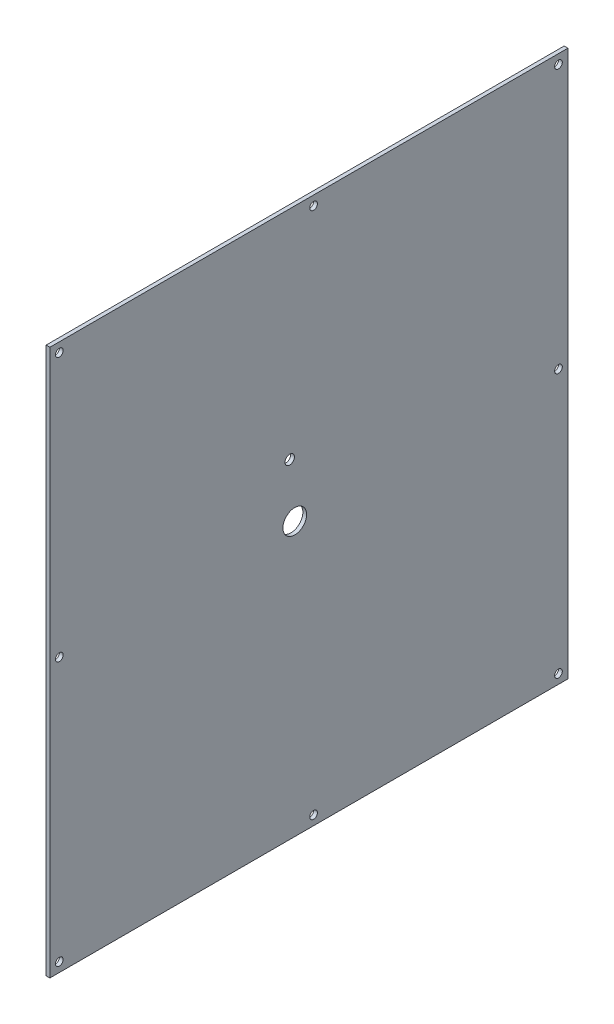
ISO-10303-21;
HEADER;
FILE_DESCRIPTION(('STEP AP214'),'2;1');
FILE_NAME('part.step','',(''),(''),'','','');
FILE_SCHEMA(('AUTOMOTIVE_DESIGN { 1 0 10303 214 1 1 1 1 }'));
ENDSEC;
DATA;
#1=APPLICATION_CONTEXT('core data for automotive mechanical design processes');
#2=APPLICATION_PROTOCOL_DEFINITION('international standard','automotive_design',2000,#1);
#3=PRODUCT_CONTEXT('',#1,'mechanical');
#4=PRODUCT('Part','Part','',(#3));
#5=PRODUCT_RELATED_PRODUCT_CATEGORY('part','',(#4));
#6=PRODUCT_DEFINITION_FORMATION('','',#4);
#7=PRODUCT_DEFINITION_CONTEXT('part definition',#1,'design');
#8=PRODUCT_DEFINITION('design','',#6,#7);
#9=PRODUCT_DEFINITION_SHAPE('','',#8);
#10=(LENGTH_UNIT() NAMED_UNIT(*) SI_UNIT(.MILLI.,.METRE.));
#11=(NAMED_UNIT(*) PLANE_ANGLE_UNIT() SI_UNIT($,.RADIAN.));
#12=(NAMED_UNIT(*) SI_UNIT($,.STERADIAN.) SOLID_ANGLE_UNIT());
#13=UNCERTAINTY_MEASURE_WITH_UNIT(LENGTH_MEASURE(1.E-05),#10,'distance_accuracy_value','');
#14=(GEOMETRIC_REPRESENTATION_CONTEXT(3) GLOBAL_UNCERTAINTY_ASSIGNED_CONTEXT((#13)) GLOBAL_UNIT_ASSIGNED_CONTEXT((#10,
#11,#12)) REPRESENTATION_CONTEXT('',''));
#15=CARTESIAN_POINT('',(0.,0.,0.));
#16=DIRECTION('',(0.,0.,1.));
#17=DIRECTION('',(1.,0.,0.));
#18=AXIS2_PLACEMENT_3D('',#15,#16,#17);
#19=CARTESIAN_POINT('',(2.54,0.,0.));
#20=DIRECTION('',(0.,1.,0.));
#21=DIRECTION('',(0.,0.,1.));
#22=AXIS2_PLACEMENT_3D('',#19,#20,#21);
#23=PLANE('',#22);
#24=DIRECTION('',(0.,0.,-1.));
#25=VECTOR('',#24,1.);
#26=CARTESIAN_POINT('',(2.54,0.,0.));
#27=LINE('',#26,#25);
#28=CARTESIAN_POINT('',(2.54,0.,-19.05));
#29=VERTEX_POINT('',#28);
#30=CARTESIAN_POINT('',(2.54,0.,-368.3));
#31=VERTEX_POINT('',#30);
#32=EDGE_CURVE('E95',#29,#31,#27,.T.);
#33=ORIENTED_EDGE('',*,*,#32,.F.);
#34=DIRECTION('',(-1.,0.,0.));
#35=VECTOR('',#34,1.);
#36=CARTESIAN_POINT('',(2.54,0.,-19.05));
#37=LINE('',#36,#35);
#38=CARTESIAN_POINT('',(0.,0.,-19.05));
#39=VERTEX_POINT('',#38);
#40=EDGE_CURVE('E170',#29,#39,#37,.T.);
#41=ORIENTED_EDGE('',*,*,#40,.T.);
#42=DIRECTION('',(0.,0.,-1.));
#43=VECTOR('',#42,1.);
#44=CARTESIAN_POINT('',(0.,0.,0.));
#45=LINE('',#44,#43);
#46=CARTESIAN_POINT('',(0.,0.,-368.3));
#47=VERTEX_POINT('',#46);
#48=EDGE_CURVE('E84',#39,#47,#45,.T.);
#49=ORIENTED_EDGE('',*,*,#48,.T.);
#50=DIRECTION('',(-1.,0.,0.));
#51=VECTOR('',#50,1.);
#52=CARTESIAN_POINT('',(2.54,0.,-368.3));
#53=LINE('',#52,#51);
#54=EDGE_CURVE('E11',#31,#47,#53,.T.);
#55=ORIENTED_EDGE('',*,*,#54,.F.);
#56=EDGE_LOOP('',(#33,#41,#49,#55));
#57=FACE_BOUND('',#56,.T.);
#58=ADVANCED_FACE('F38',(#57),#23,.F.);
#59=CARTESIAN_POINT('',(2.54,0.,-368.3));
#60=DIRECTION('',(0.,0.,1.));
#61=DIRECTION('',(1.,0.,0.));
#62=AXIS2_PLACEMENT_3D('',#59,#60,#61);
#63=PLANE('',#62);
#64=DIRECTION('',(0.,1.,0.));
#65=VECTOR('',#64,1.);
#66=CARTESIAN_POINT('',(0.,0.,-368.3));
#67=LINE('',#66,#65);
#68=CARTESIAN_POINT('',(0.,368.3,-368.3));
#69=VERTEX_POINT('',#68);
#70=EDGE_CURVE('E74',#47,#69,#67,.T.);
#71=ORIENTED_EDGE('',*,*,#70,.T.);
#72=DIRECTION('',(-1.,0.,0.));
#73=VECTOR('',#72,1.);
#74=CARTESIAN_POINT('',(2.54,368.3,-368.3));
#75=LINE('',#74,#73);
#76=CARTESIAN_POINT('',(2.54,368.3,-368.3));
#77=VERTEX_POINT('',#76);
#78=EDGE_CURVE('E46',#77,#69,#75,.T.);
#79=ORIENTED_EDGE('',*,*,#78,.F.);
#80=DIRECTION('',(0.,1.,0.));
#81=VECTOR('',#80,1.);
#82=CARTESIAN_POINT('',(2.54,0.,-368.3));
#83=LINE('',#82,#81);
#84=EDGE_CURVE('E62',#31,#77,#83,.T.);
#85=ORIENTED_EDGE('',*,*,#84,.F.);
#86=ORIENTED_EDGE('',*,*,#54,.T.);
#87=EDGE_LOOP('',(#71,#79,#85,#86));
#88=FACE_BOUND('',#87,.T.);
#89=ADVANCED_FACE('F76',(#88),#63,.F.);
#90=CARTESIAN_POINT('',(2.54,368.3,0.));
#91=DIRECTION('',(0.,-1.,0.));
#92=DIRECTION('',(0.,0.,-1.));
#93=AXIS2_PLACEMENT_3D('',#90,#91,#92);
#94=PLANE('',#93);
#95=DIRECTION('',(0.,0.,1.));
#96=VECTOR('',#95,1.);
#97=CARTESIAN_POINT('',(0.,368.3,0.));
#98=LINE('',#97,#96);
#99=CARTESIAN_POINT('',(0.,368.3,-19.05));
#100=VERTEX_POINT('',#99);
#101=EDGE_CURVE('E83',#69,#100,#98,.T.);
#102=ORIENTED_EDGE('',*,*,#101,.T.);
#103=DIRECTION('',(-1.,0.,0.));
#104=VECTOR('',#103,1.);
#105=CARTESIAN_POINT('',(2.54,368.3,-19.05));
#106=LINE('',#105,#104);
#107=CARTESIAN_POINT('',(2.54,368.3,-19.05));
#108=VERTEX_POINT('',#107);
#109=EDGE_CURVE('E53',#108,#100,#106,.T.);
#110=ORIENTED_EDGE('',*,*,#109,.F.);
#111=DIRECTION('',(0.,0.,1.));
#112=VECTOR('',#111,1.);
#113=CARTESIAN_POINT('',(2.54,368.3,0.));
#114=LINE('',#113,#112);
#115=EDGE_CURVE('E89',#77,#108,#114,.T.);
#116=ORIENTED_EDGE('',*,*,#115,.F.);
#117=ORIENTED_EDGE('',*,*,#78,.T.);
#118=EDGE_LOOP('',(#102,#110,#116,#117));
#119=FACE_BOUND('',#118,.T.);
#120=ADVANCED_FACE('F88',(#119),#94,.F.);
#121=CARTESIAN_POINT('',(2.54,0.,0.));
#122=DIRECTION('',(-1.,0.,0.));
#123=DIRECTION('',(0.,0.,1.));
#124=AXIS2_PLACEMENT_3D('',#121,#122,#123);
#125=PLANE('',#124);
#126=CARTESIAN_POINT('',(2.54,221.84404151276,-180.737580341639));
#127=DIRECTION('',(-1.,0.,0.));
#128=DIRECTION('',(0.,0.,1.));
#129=AXIS2_PLACEMENT_3D('',#126,#127,#128);
#130=CIRCLE('',#129,3.175);
#131=CARTESIAN_POINT('',(2.54,221.84404151276,-177.562580341639));
#132=VERTEX_POINT('',#131);
#133=EDGE_CURVE('E187',#132,#132,#130,.T.);
#134=ORIENTED_EDGE('',*,*,#133,.T.);
#135=EDGE_LOOP('',(#134));
#136=FACE_BOUND('',#135,.T.);
#137=CARTESIAN_POINT('',(2.54,184.15,-184.15));
#138=DIRECTION('',(-1.,0.,0.));
#139=DIRECTION('',(0.,0.,1.));
#140=AXIS2_PLACEMENT_3D('',#137,#138,#139);
#141=CIRCLE('',#140,8.00000000000001);
#142=CARTESIAN_POINT('',(2.54,184.15,-176.15));
#143=VERTEX_POINT('',#142);
#144=EDGE_CURVE('E179',#143,#143,#141,.T.);
#145=ORIENTED_EDGE('',*,*,#144,.T.);
#146=EDGE_LOOP('',(#145));
#147=FACE_BOUND('',#146,.T.);
#148=CARTESIAN_POINT('',(2.54,361.95,-361.95));
#149=DIRECTION('',(1.,0.,0.));
#150=DIRECTION('',(0.,0.,-1.));
#151=AXIS2_PLACEMENT_3D('',#148,#149,#150);
#152=CIRCLE('',#151,2.5908);
#153=CARTESIAN_POINT('',(2.54,361.95,-364.5408));
#154=VERTEX_POINT('',#153);
#155=EDGE_CURVE('E166',#154,#154,#152,.T.);
#156=ORIENTED_EDGE('',*,*,#155,.F.);
#157=EDGE_LOOP('',(#156));
#158=FACE_BOUND('',#157,.T.);
#159=CARTESIAN_POINT('',(2.54,6.35,-361.95));
#160=DIRECTION('',(1.,0.,0.));
#161=DIRECTION('',(0.,0.,-1.));
#162=AXIS2_PLACEMENT_3D('',#159,#160,#161);
#163=CIRCLE('',#162,2.59079999999999);
#164=CARTESIAN_POINT('',(2.54,6.35,-364.5408));
#165=VERTEX_POINT('',#164);
#166=EDGE_CURVE('E158',#165,#165,#163,.T.);
#167=ORIENTED_EDGE('',*,*,#166,.F.);
#168=EDGE_LOOP('',(#167));
#169=FACE_BOUND('',#168,.T.);
#170=CARTESIAN_POINT('',(2.54,6.35,-25.4));
#171=DIRECTION('',(1.,0.,0.));
#172=DIRECTION('',(0.,0.,-1.));
#173=AXIS2_PLACEMENT_3D('',#170,#171,#172);
#174=CIRCLE('',#173,2.59079999999999);
#175=CARTESIAN_POINT('',(2.54,6.35,-27.9908));
#176=VERTEX_POINT('',#175);
#177=EDGE_CURVE('E150',#176,#176,#174,.T.);
#178=ORIENTED_EDGE('',*,*,#177,.F.);
#179=EDGE_LOOP('',(#178));
#180=FACE_BOUND('',#179,.T.);
#181=CARTESIAN_POINT('',(2.54,361.95,-25.4));
#182=DIRECTION('',(1.,0.,0.));
#183=DIRECTION('',(0.,0.,-1.));
#184=AXIS2_PLACEMENT_3D('',#181,#182,#183);
#185=CIRCLE('',#184,2.5908);
#186=CARTESIAN_POINT('',(2.54,361.95,-27.9908));
#187=VERTEX_POINT('',#186);
#188=EDGE_CURVE('E142',#187,#187,#185,.T.);
#189=ORIENTED_EDGE('',*,*,#188,.F.);
#190=EDGE_LOOP('',(#189));
#191=FACE_BOUND('',#190,.T.);
#192=CARTESIAN_POINT('',(2.54,184.15,-25.4));
#193=DIRECTION('',(1.,0.,0.));
#194=DIRECTION('',(0.,0.,-1.));
#195=AXIS2_PLACEMENT_3D('',#192,#193,#194);
#196=CIRCLE('',#195,2.59079999999998);
#197=CARTESIAN_POINT('',(2.54,184.15,-27.9908));
#198=VERTEX_POINT('',#197);
#199=EDGE_CURVE('E134',#198,#198,#196,.T.);
#200=ORIENTED_EDGE('',*,*,#199,.F.);
#201=EDGE_LOOP('',(#200));
#202=FACE_BOUND('',#201,.T.);
#203=CARTESIAN_POINT('',(2.54,184.15,-361.95));
#204=DIRECTION('',(1.,0.,0.));
#205=DIRECTION('',(0.,0.,-1.));
#206=AXIS2_PLACEMENT_3D('',#203,#204,#205);
#207=CIRCLE('',#206,2.59079999999998);
#208=CARTESIAN_POINT('',(2.54,184.15,-364.5408));
#209=VERTEX_POINT('',#208);
#210=EDGE_CURVE('E126',#209,#209,#207,.T.);
#211=ORIENTED_EDGE('',*,*,#210,.F.);
#212=EDGE_LOOP('',(#211));
#213=FACE_BOUND('',#212,.T.);
#214=CARTESIAN_POINT('',(2.54,6.35,-196.85));
#215=DIRECTION('',(1.,0.,0.));
#216=DIRECTION('',(0.,0.,-1.));
#217=AXIS2_PLACEMENT_3D('',#214,#215,#216);
#218=CIRCLE('',#217,2.59079999999999);
#219=CARTESIAN_POINT('',(2.54,6.35,-199.4408));
#220=VERTEX_POINT('',#219);
#221=EDGE_CURVE('E118',#220,#220,#218,.T.);
#222=ORIENTED_EDGE('',*,*,#221,.F.);
#223=EDGE_LOOP('',(#222));
#224=FACE_BOUND('',#223,.T.);
#225=CARTESIAN_POINT('',(2.54,361.95,-196.85));
#226=DIRECTION('',(1.,0.,0.));
#227=DIRECTION('',(0.,0.,-1.));
#228=AXIS2_PLACEMENT_3D('',#225,#226,#227);
#229=CIRCLE('',#228,2.5908);
#230=CARTESIAN_POINT('',(2.54,361.95,-199.4408));
#231=VERTEX_POINT('',#230);
#232=EDGE_CURVE('E110',#231,#231,#229,.T.);
#233=ORIENTED_EDGE('',*,*,#232,.F.);
#234=EDGE_LOOP('',(#233));
#235=FACE_BOUND('',#234,.T.);
#236=ORIENTED_EDGE('',*,*,#115,.T.);
#237=DIRECTION('',(0.,-1.,0.));
#238=VECTOR('',#237,1.);
#239=CARTESIAN_POINT('',(2.54,368.3,-19.05));
#240=LINE('',#239,#238);
#241=EDGE_CURVE('E173',#108,#29,#240,.T.);
#242=ORIENTED_EDGE('',*,*,#241,.T.);
#243=ORIENTED_EDGE('',*,*,#32,.T.);
#244=ORIENTED_EDGE('',*,*,#84,.T.);
#245=EDGE_LOOP('',(#236,#242,#243,#244));
#246=FACE_BOUND('',#245,.T.);
#247=ADVANCED_FACE('F199',(#136,#147,#158,#169,#180,#191,#202,#213,#224,#235,#246),#125,.F.);
#248=CARTESIAN_POINT('',(0.,0.,0.));
#249=DIRECTION('',(-1.,0.,0.));
#250=DIRECTION('',(0.,0.,1.));
#251=AXIS2_PLACEMENT_3D('',#248,#249,#250);
#252=PLANE('',#251);
#253=CARTESIAN_POINT('',(0.,221.84404151276,-180.737580341639));
#254=DIRECTION('',(-1.,0.,0.));
#255=DIRECTION('',(0.,0.,1.));
#256=AXIS2_PLACEMENT_3D('',#253,#254,#255);
#257=CIRCLE('',#256,3.175);
#258=CARTESIAN_POINT('',(0.,221.84404151276,-177.562580341639));
#259=VERTEX_POINT('',#258);
#260=EDGE_CURVE('E191',#259,#259,#257,.T.);
#261=ORIENTED_EDGE('',*,*,#260,.F.);
#262=EDGE_LOOP('',(#261));
#263=FACE_BOUND('',#262,.T.);
#264=CARTESIAN_POINT('',(0.,184.15,-184.15));
#265=DIRECTION('',(-1.,0.,0.));
#266=DIRECTION('',(0.,0.,1.));
#267=AXIS2_PLACEMENT_3D('',#264,#265,#266);
#268=CIRCLE('',#267,8.00000000000001);
#269=CARTESIAN_POINT('',(0.,184.15,-176.15));
#270=VERTEX_POINT('',#269);
#271=EDGE_CURVE('E183',#270,#270,#268,.T.);
#272=ORIENTED_EDGE('',*,*,#271,.F.);
#273=EDGE_LOOP('',(#272));
#274=FACE_BOUND('',#273,.T.);
#275=DIRECTION('',(0.,-1.,0.));
#276=VECTOR('',#275,1.);
#277=CARTESIAN_POINT('',(0.,368.3,-19.05));
#278=LINE('',#277,#276);
#279=EDGE_CURVE('E93',#100,#39,#278,.T.);
#280=ORIENTED_EDGE('',*,*,#279,.F.);
#281=ORIENTED_EDGE('',*,*,#101,.F.);
#282=ORIENTED_EDGE('',*,*,#70,.F.);
#283=ORIENTED_EDGE('',*,*,#48,.F.);
#284=EDGE_LOOP('',(#280,#281,#282,#283));
#285=FACE_BOUND('',#284,.T.);
#286=CARTESIAN_POINT('',(0.,361.95,-361.95));
#287=DIRECTION('',(1.,0.,0.));
#288=DIRECTION('',(0.,0.,-1.));
#289=AXIS2_PLACEMENT_3D('',#286,#287,#288);
#290=CIRCLE('',#289,2.5908);
#291=CARTESIAN_POINT('',(0.,361.95,-364.5408));
#292=VERTEX_POINT('',#291);
#293=EDGE_CURVE('E162',#292,#292,#290,.T.);
#294=ORIENTED_EDGE('',*,*,#293,.T.);
#295=EDGE_LOOP('',(#294));
#296=FACE_BOUND('',#295,.T.);
#297=CARTESIAN_POINT('',(0.,6.35,-361.95));
#298=DIRECTION('',(1.,0.,0.));
#299=DIRECTION('',(0.,0.,-1.));
#300=AXIS2_PLACEMENT_3D('',#297,#298,#299);
#301=CIRCLE('',#300,2.59079999999999);
#302=CARTESIAN_POINT('',(0.,6.35,-364.5408));
#303=VERTEX_POINT('',#302);
#304=EDGE_CURVE('E154',#303,#303,#301,.T.);
#305=ORIENTED_EDGE('',*,*,#304,.T.);
#306=EDGE_LOOP('',(#305));
#307=FACE_BOUND('',#306,.T.);
#308=CARTESIAN_POINT('',(0.,6.35,-25.4));
#309=DIRECTION('',(1.,0.,0.));
#310=DIRECTION('',(0.,0.,-1.));
#311=AXIS2_PLACEMENT_3D('',#308,#309,#310);
#312=CIRCLE('',#311,2.59079999999999);
#313=CARTESIAN_POINT('',(0.,6.35,-27.9908));
#314=VERTEX_POINT('',#313);
#315=EDGE_CURVE('E146',#314,#314,#312,.T.);
#316=ORIENTED_EDGE('',*,*,#315,.T.);
#317=EDGE_LOOP('',(#316));
#318=FACE_BOUND('',#317,.T.);
#319=CARTESIAN_POINT('',(0.,361.95,-25.4));
#320=DIRECTION('',(1.,0.,0.));
#321=DIRECTION('',(0.,0.,-1.));
#322=AXIS2_PLACEMENT_3D('',#319,#320,#321);
#323=CIRCLE('',#322,2.5908);
#324=CARTESIAN_POINT('',(0.,361.95,-27.9908));
#325=VERTEX_POINT('',#324);
#326=EDGE_CURVE('E138',#325,#325,#323,.T.);
#327=ORIENTED_EDGE('',*,*,#326,.T.);
#328=EDGE_LOOP('',(#327));
#329=FACE_BOUND('',#328,.T.);
#330=CARTESIAN_POINT('',(0.,184.15,-25.4));
#331=DIRECTION('',(1.,0.,0.));
#332=DIRECTION('',(0.,0.,-1.));
#333=AXIS2_PLACEMENT_3D('',#330,#331,#332);
#334=CIRCLE('',#333,2.59079999999998);
#335=CARTESIAN_POINT('',(0.,184.15,-27.9908));
#336=VERTEX_POINT('',#335);
#337=EDGE_CURVE('E130',#336,#336,#334,.T.);
#338=ORIENTED_EDGE('',*,*,#337,.T.);
#339=EDGE_LOOP('',(#338));
#340=FACE_BOUND('',#339,.T.);
#341=CARTESIAN_POINT('',(0.,184.15,-361.95));
#342=DIRECTION('',(1.,0.,0.));
#343=DIRECTION('',(0.,0.,-1.));
#344=AXIS2_PLACEMENT_3D('',#341,#342,#343);
#345=CIRCLE('',#344,2.59079999999998);
#346=CARTESIAN_POINT('',(0.,184.15,-364.5408));
#347=VERTEX_POINT('',#346);
#348=EDGE_CURVE('E122',#347,#347,#345,.T.);
#349=ORIENTED_EDGE('',*,*,#348,.T.);
#350=EDGE_LOOP('',(#349));
#351=FACE_BOUND('',#350,.T.);
#352=CARTESIAN_POINT('',(0.,6.35,-196.85));
#353=DIRECTION('',(1.,0.,0.));
#354=DIRECTION('',(0.,0.,-1.));
#355=AXIS2_PLACEMENT_3D('',#352,#353,#354);
#356=CIRCLE('',#355,2.59079999999999);
#357=CARTESIAN_POINT('',(0.,6.35,-199.4408));
#358=VERTEX_POINT('',#357);
#359=EDGE_CURVE('E114',#358,#358,#356,.T.);
#360=ORIENTED_EDGE('',*,*,#359,.T.);
#361=EDGE_LOOP('',(#360));
#362=FACE_BOUND('',#361,.T.);
#363=CARTESIAN_POINT('',(0.,361.95,-196.85));
#364=DIRECTION('',(1.,0.,0.));
#365=DIRECTION('',(0.,0.,-1.));
#366=AXIS2_PLACEMENT_3D('',#363,#364,#365);
#367=CIRCLE('',#366,2.5908);
#368=CARTESIAN_POINT('',(0.,361.95,-199.4408));
#369=VERTEX_POINT('',#368);
#370=EDGE_CURVE('E102',#369,#369,#367,.T.);
#371=ORIENTED_EDGE('',*,*,#370,.T.);
#372=EDGE_LOOP('',(#371));
#373=FACE_BOUND('',#372,.T.);
#374=ADVANCED_FACE('F91',(#263,#274,#285,#296,#307,#318,#329,#340,#351,#362,#373),#252,.T.);
#375=CARTESIAN_POINT('',(2.54,361.95,-196.85));
#376=DIRECTION('',(1.,0.,0.));
#377=DIRECTION('',(0.,0.,-1.));
#378=AXIS2_PLACEMENT_3D('',#375,#376,#377);
#379=CYLINDRICAL_SURFACE('',#378,2.5908);
#380=ORIENTED_EDGE('',*,*,#370,.F.);
#381=EDGE_LOOP('',(#380));
#382=FACE_BOUND('',#381,.T.);
#383=ORIENTED_EDGE('',*,*,#232,.T.);
#384=EDGE_LOOP('',(#383));
#385=FACE_BOUND('',#384,.T.);
#386=ADVANCED_FACE('F211',(#382,#385),#379,.F.);
#387=CARTESIAN_POINT('',(2.54,6.35,-196.85));
#388=DIRECTION('',(1.,0.,0.));
#389=DIRECTION('',(0.,0.,-1.));
#390=AXIS2_PLACEMENT_3D('',#387,#388,#389);
#391=CYLINDRICAL_SURFACE('',#390,2.59079999999999);
#392=ORIENTED_EDGE('',*,*,#359,.F.);
#393=EDGE_LOOP('',(#392));
#394=FACE_BOUND('',#393,.T.);
#395=ORIENTED_EDGE('',*,*,#221,.T.);
#396=EDGE_LOOP('',(#395));
#397=FACE_BOUND('',#396,.T.);
#398=ADVANCED_FACE('F246',(#394,#397),#391,.F.);
#399=CARTESIAN_POINT('',(2.54,184.15,-361.95));
#400=DIRECTION('',(1.,0.,0.));
#401=DIRECTION('',(0.,0.,-1.));
#402=AXIS2_PLACEMENT_3D('',#399,#400,#401);
#403=CYLINDRICAL_SURFACE('',#402,2.59079999999998);
#404=ORIENTED_EDGE('',*,*,#348,.F.);
#405=EDGE_LOOP('',(#404));
#406=FACE_BOUND('',#405,.T.);
#407=ORIENTED_EDGE('',*,*,#210,.T.);
#408=EDGE_LOOP('',(#407));
#409=FACE_BOUND('',#408,.T.);
#410=ADVANCED_FACE('F250',(#406,#409),#403,.F.);
#411=CARTESIAN_POINT('',(2.54,184.15,-25.4));
#412=DIRECTION('',(1.,0.,0.));
#413=DIRECTION('',(0.,0.,-1.));
#414=AXIS2_PLACEMENT_3D('',#411,#412,#413);
#415=CYLINDRICAL_SURFACE('',#414,2.59079999999998);
#416=ORIENTED_EDGE('',*,*,#337,.F.);
#417=EDGE_LOOP('',(#416));
#418=FACE_BOUND('',#417,.T.);
#419=ORIENTED_EDGE('',*,*,#199,.T.);
#420=EDGE_LOOP('',(#419));
#421=FACE_BOUND('',#420,.T.);
#422=ADVANCED_FACE('F254',(#418,#421),#415,.F.);
#423=CARTESIAN_POINT('',(2.54,361.95,-25.4));
#424=DIRECTION('',(1.,0.,0.));
#425=DIRECTION('',(0.,0.,-1.));
#426=AXIS2_PLACEMENT_3D('',#423,#424,#425);
#427=CYLINDRICAL_SURFACE('',#426,2.5908);
#428=ORIENTED_EDGE('',*,*,#326,.F.);
#429=EDGE_LOOP('',(#428));
#430=FACE_BOUND('',#429,.T.);
#431=ORIENTED_EDGE('',*,*,#188,.T.);
#432=EDGE_LOOP('',(#431));
#433=FACE_BOUND('',#432,.T.);
#434=ADVANCED_FACE('F258',(#430,#433),#427,.F.);
#435=CARTESIAN_POINT('',(2.54,6.35,-25.4));
#436=DIRECTION('',(1.,0.,0.));
#437=DIRECTION('',(0.,0.,-1.));
#438=AXIS2_PLACEMENT_3D('',#435,#436,#437);
#439=CYLINDRICAL_SURFACE('',#438,2.59079999999999);
#440=ORIENTED_EDGE('',*,*,#315,.F.);
#441=EDGE_LOOP('',(#440));
#442=FACE_BOUND('',#441,.T.);
#443=ORIENTED_EDGE('',*,*,#177,.T.);
#444=EDGE_LOOP('',(#443));
#445=FACE_BOUND('',#444,.T.);
#446=ADVANCED_FACE('F262',(#442,#445),#439,.F.);
#447=CARTESIAN_POINT('',(2.54,6.35,-361.95));
#448=DIRECTION('',(1.,0.,0.));
#449=DIRECTION('',(0.,0.,-1.));
#450=AXIS2_PLACEMENT_3D('',#447,#448,#449);
#451=CYLINDRICAL_SURFACE('',#450,2.59079999999999);
#452=ORIENTED_EDGE('',*,*,#304,.F.);
#453=EDGE_LOOP('',(#452));
#454=FACE_BOUND('',#453,.T.);
#455=ORIENTED_EDGE('',*,*,#166,.T.);
#456=EDGE_LOOP('',(#455));
#457=FACE_BOUND('',#456,.T.);
#458=ADVANCED_FACE('F266',(#454,#457),#451,.F.);
#459=CARTESIAN_POINT('',(2.54,361.95,-361.95));
#460=DIRECTION('',(1.,0.,0.));
#461=DIRECTION('',(0.,0.,-1.));
#462=AXIS2_PLACEMENT_3D('',#459,#460,#461);
#463=CYLINDRICAL_SURFACE('',#462,2.5908);
#464=ORIENTED_EDGE('',*,*,#293,.F.);
#465=EDGE_LOOP('',(#464));
#466=FACE_BOUND('',#465,.T.);
#467=ORIENTED_EDGE('',*,*,#155,.T.);
#468=EDGE_LOOP('',(#467));
#469=FACE_BOUND('',#468,.T.);
#470=ADVANCED_FACE('F222',(#466,#469),#463,.F.);
#471=CARTESIAN_POINT('',(2.54,368.3,-19.05));
#472=DIRECTION('',(0.,0.,-1.));
#473=DIRECTION('',(0.,1.,0.));
#474=AXIS2_PLACEMENT_3D('',#471,#472,#473);
#475=PLANE('',#474);
#476=ORIENTED_EDGE('',*,*,#279,.T.);
#477=ORIENTED_EDGE('',*,*,#40,.F.);
#478=ORIENTED_EDGE('',*,*,#241,.F.);
#479=ORIENTED_EDGE('',*,*,#109,.T.);
#480=EDGE_LOOP('',(#476,#477,#478,#479));
#481=FACE_BOUND('',#480,.T.);
#482=ADVANCED_FACE('F216',(#481),#475,.F.);
#483=CARTESIAN_POINT('',(2.54,184.15,-184.15));
#484=DIRECTION('',(-1.,0.,0.));
#485=DIRECTION('',(0.,0.,1.));
#486=AXIS2_PLACEMENT_3D('',#483,#484,#485);
#487=CYLINDRICAL_SURFACE('',#486,8.00000000000001);
#488=ORIENTED_EDGE('',*,*,#144,.F.);
#489=EDGE_LOOP('',(#488));
#490=FACE_BOUND('',#489,.T.);
#491=ORIENTED_EDGE('',*,*,#271,.T.);
#492=EDGE_LOOP('',(#491));
#493=FACE_BOUND('',#492,.T.);
#494=ADVANCED_FACE('F205',(#490,#493),#487,.F.);
#495=CARTESIAN_POINT('',(2.54,221.84404151276,-180.737580341639));
#496=DIRECTION('',(-1.,0.,0.));
#497=DIRECTION('',(0.,0.,1.));
#498=AXIS2_PLACEMENT_3D('',#495,#496,#497);
#499=CYLINDRICAL_SURFACE('',#498,3.175);
#500=ORIENTED_EDGE('',*,*,#133,.F.);
#501=EDGE_LOOP('',(#500));
#502=FACE_BOUND('',#501,.T.);
#503=ORIENTED_EDGE('',*,*,#260,.T.);
#504=EDGE_LOOP('',(#503));
#505=FACE_BOUND('',#504,.T.);
#506=ADVANCED_FACE('F202',(#502,#505),#499,.F.);
#507=CLOSED_SHELL('',(#58,#89,#120,#247,#374,#386,#398,#410,#422,#434,#446,#458,#470,#482,#494,#506));
#508=MANIFOLD_SOLID_BREP('B2',#507);
#509=ADVANCED_BREP_SHAPE_REPRESENTATION('',(#18,#508),#14);
#510=SHAPE_DEFINITION_REPRESENTATION(#9,#509);
ENDSEC;
END-ISO-10303-21;
